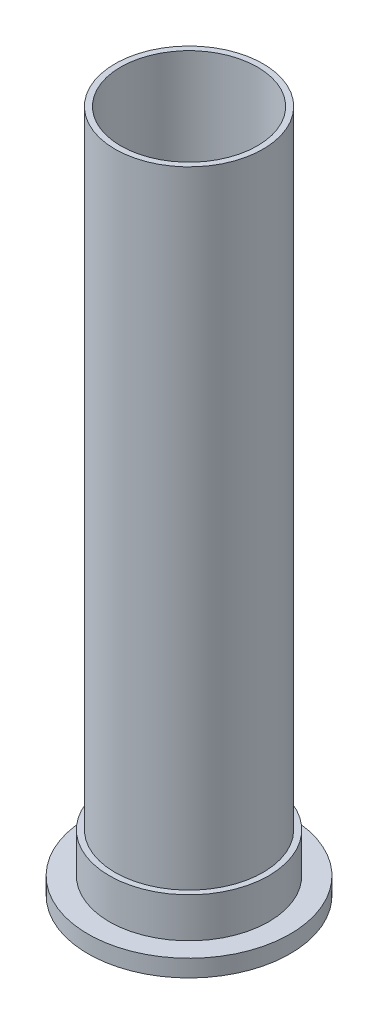
ISO-10303-21;
HEADER;
FILE_DESCRIPTION(('STEP AP214'),'2;1');
FILE_NAME('part.step','',(''),(''),'','','');
FILE_SCHEMA(('AUTOMOTIVE_DESIGN { 1 0 10303 214 1 1 1 1 }'));
ENDSEC;
DATA;
#1=APPLICATION_CONTEXT('core data for automotive mechanical design processes');
#2=APPLICATION_PROTOCOL_DEFINITION('international standard','automotive_design',2000,#1);
#3=PRODUCT_CONTEXT('',#1,'mechanical');
#4=PRODUCT('Part','Part','',(#3));
#5=PRODUCT_RELATED_PRODUCT_CATEGORY('part','',(#4));
#6=PRODUCT_DEFINITION_FORMATION('','',#4);
#7=PRODUCT_DEFINITION_CONTEXT('part definition',#1,'design');
#8=PRODUCT_DEFINITION('design','',#6,#7);
#9=PRODUCT_DEFINITION_SHAPE('','',#8);
#10=(LENGTH_UNIT() NAMED_UNIT(*) SI_UNIT(.MILLI.,.METRE.));
#11=(NAMED_UNIT(*) PLANE_ANGLE_UNIT() SI_UNIT($,.RADIAN.));
#12=(NAMED_UNIT(*) SI_UNIT($,.STERADIAN.) SOLID_ANGLE_UNIT());
#13=UNCERTAINTY_MEASURE_WITH_UNIT(LENGTH_MEASURE(1.E-05),#10,'distance_accuracy_value','');
#14=(GEOMETRIC_REPRESENTATION_CONTEXT(3) GLOBAL_UNCERTAINTY_ASSIGNED_CONTEXT((#13)) GLOBAL_UNIT_ASSIGNED_CONTEXT((#10,
#11,#12)) REPRESENTATION_CONTEXT('',''));
#15=CARTESIAN_POINT('',(0.,0.,0.));
#16=DIRECTION('',(0.,0.,1.));
#17=DIRECTION('',(1.,0.,0.));
#18=AXIS2_PLACEMENT_3D('',#15,#16,#17);
#19=CARTESIAN_POINT('',(0.,9.525,0.));
#20=DIRECTION('',(0.,-1.,0.));
#21=DIRECTION('',(0.,0.,-1.));
#22=AXIS2_PLACEMENT_3D('',#19,#20,#21);
#23=PLANE('',#22);
#24=CARTESIAN_POINT('',(0.,9.525,0.));
#25=DIRECTION('',(0.,-1.,0.));
#26=DIRECTION('',(0.,0.,-1.));
#27=AXIS2_PLACEMENT_3D('',#24,#25,#26);
#28=CIRCLE('',#27,56.35625);
#29=CARTESIAN_POINT('',(0.,9.525,-56.35625));
#30=VERTEX_POINT('',#29);
#31=EDGE_CURVE('E51',#30,#30,#28,.T.);
#32=ORIENTED_EDGE('',*,*,#31,.F.);
#33=EDGE_LOOP('',(#32));
#34=FACE_BOUND('',#33,.T.);
#35=CARTESIAN_POINT('',(0.,9.525,0.));
#36=DIRECTION('',(0.,-1.,0.));
#37=DIRECTION('',(0.,0.,-1.));
#38=AXIS2_PLACEMENT_3D('',#35,#36,#37);
#39=CIRCLE('',#38,44.45);
#40=CARTESIAN_POINT('',(0.,9.525,-44.45));
#41=VERTEX_POINT('',#40);
#42=EDGE_CURVE('E10',#41,#41,#39,.F.);
#43=ORIENTED_EDGE('',*,*,#42,.F.);
#44=EDGE_LOOP('',(#43));
#45=FACE_BOUND('',#44,.T.);
#46=ADVANCED_FACE('F35',(#34,#45),#23,.F.);
#47=CARTESIAN_POINT('',(0.,381.,0.));
#48=DIRECTION('',(0.,-1.,0.));
#49=DIRECTION('',(0.,0.,-1.));
#50=AXIS2_PLACEMENT_3D('',#47,#48,#49);
#51=CYLINDRICAL_SURFACE('',#50,38.1);
#52=CARTESIAN_POINT('',(0.,381.,0.));
#53=DIRECTION('',(0.,1.,0.));
#54=DIRECTION('',(0.,0.,1.));
#55=AXIS2_PLACEMENT_3D('',#52,#53,#54);
#56=CIRCLE('',#55,38.1);
#57=CARTESIAN_POINT('',(0.,381.,38.1));
#58=VERTEX_POINT('',#57);
#59=EDGE_CURVE('E46',#58,#58,#56,.T.);
#60=ORIENTED_EDGE('',*,*,#59,.T.);
#61=EDGE_LOOP('',(#60));
#62=FACE_BOUND('',#61,.T.);
#63=CARTESIAN_POINT('',(0.,28.575,0.));
#64=DIRECTION('',(0.,-1.,0.));
#65=DIRECTION('',(0.,0.,-1.));
#66=AXIS2_PLACEMENT_3D('',#63,#64,#65);
#67=CIRCLE('',#66,38.1);
#68=CARTESIAN_POINT('',(0.,28.575,-38.1));
#69=VERTEX_POINT('',#68);
#70=EDGE_CURVE('E54',#69,#69,#67,.T.);
#71=ORIENTED_EDGE('',*,*,#70,.T.);
#72=EDGE_LOOP('',(#71));
#73=FACE_BOUND('',#72,.T.);
#74=ADVANCED_FACE('F80',(#62,#73),#51,.F.);
#75=CARTESIAN_POINT('',(0.,381.,0.));
#76=DIRECTION('',(0.,-1.,0.));
#77=DIRECTION('',(0.,0.,-1.));
#78=AXIS2_PLACEMENT_3D('',#75,#76,#77);
#79=CYLINDRICAL_SURFACE('',#78,41.275);
#80=CARTESIAN_POINT('',(0.,31.75,0.));
#81=DIRECTION('',(0.,1.,0.));
#82=DIRECTION('',(0.,0.,1.));
#83=AXIS2_PLACEMENT_3D('',#80,#81,#82);
#84=CIRCLE('',#83,41.275);
#85=CARTESIAN_POINT('',(0.,31.75,41.275));
#86=VERTEX_POINT('',#85);
#87=EDGE_CURVE('E125',#86,#86,#84,.T.);
#88=ORIENTED_EDGE('',*,*,#87,.T.);
#89=EDGE_LOOP('',(#88));
#90=FACE_BOUND('',#89,.T.);
#91=CARTESIAN_POINT('',(0.,381.,0.));
#92=DIRECTION('',(0.,1.,0.));
#93=DIRECTION('',(0.,0.,1.));
#94=AXIS2_PLACEMENT_3D('',#91,#92,#93);
#95=CIRCLE('',#94,41.275);
#96=CARTESIAN_POINT('',(0.,381.,41.275));
#97=VERTEX_POINT('',#96);
#98=EDGE_CURVE('E42',#97,#97,#95,.T.);
#99=ORIENTED_EDGE('',*,*,#98,.F.);
#100=EDGE_LOOP('',(#99));
#101=FACE_BOUND('',#100,.T.);
#102=ADVANCED_FACE('F37',(#90,#101),#79,.T.);
#103=CARTESIAN_POINT('',(0.,381.,0.));
#104=DIRECTION('',(0.,1.,0.));
#105=DIRECTION('',(0.,0.,1.));
#106=AXIS2_PLACEMENT_3D('',#103,#104,#105);
#107=PLANE('',#106);
#108=ORIENTED_EDGE('',*,*,#98,.T.);
#109=EDGE_LOOP('',(#108));
#110=FACE_BOUND('',#109,.T.);
#111=ORIENTED_EDGE('',*,*,#59,.F.);
#112=EDGE_LOOP('',(#111));
#113=FACE_BOUND('',#112,.T.);
#114=ADVANCED_FACE('F94',(#110,#113),#107,.T.);
#115=CARTESIAN_POINT('',(0.,0.,0.));
#116=DIRECTION('',(0.,1.,0.));
#117=DIRECTION('',(0.,0.,1.));
#118=AXIS2_PLACEMENT_3D('',#115,#116,#117);
#119=PLANE('',#118);
#120=CARTESIAN_POINT('',(0.,0.,0.));
#121=DIRECTION('',(0.,-1.,0.));
#122=DIRECTION('',(0.,0.,-1.));
#123=AXIS2_PLACEMENT_3D('',#120,#121,#122);
#124=CIRCLE('',#123,39.75);
#125=CARTESIAN_POINT('',(0.,0.,-39.75));
#126=VERTEX_POINT('',#125);
#127=EDGE_CURVE('E62',#126,#126,#124,.T.);
#128=ORIENTED_EDGE('',*,*,#127,.F.);
#129=EDGE_LOOP('',(#128));
#130=FACE_BOUND('',#129,.T.);
#131=CARTESIAN_POINT('',(0.,0.,0.));
#132=DIRECTION('',(0.,-1.,0.));
#133=DIRECTION('',(0.,0.,-1.));
#134=AXIS2_PLACEMENT_3D('',#131,#132,#133);
#135=CIRCLE('',#134,56.35625);
#136=CARTESIAN_POINT('',(0.,0.,-56.35625));
#137=VERTEX_POINT('',#136);
#138=EDGE_CURVE('E56',#137,#137,#135,.T.);
#139=ORIENTED_EDGE('',*,*,#138,.T.);
#140=EDGE_LOOP('',(#139));
#141=FACE_BOUND('',#140,.T.);
#142=ADVANCED_FACE('F92',(#130,#141),#119,.F.);
#143=CARTESIAN_POINT('',(0.,9.525,0.));
#144=DIRECTION('',(0.,-1.,0.));
#145=DIRECTION('',(0.,0.,-1.));
#146=AXIS2_PLACEMENT_3D('',#143,#144,#145);
#147=CYLINDRICAL_SURFACE('',#146,56.35625);
#148=ORIENTED_EDGE('',*,*,#31,.T.);
#149=EDGE_LOOP('',(#148));
#150=FACE_BOUND('',#149,.T.);
#151=ORIENTED_EDGE('',*,*,#138,.F.);
#152=EDGE_LOOP('',(#151));
#153=FACE_BOUND('',#152,.T.);
#154=ADVANCED_FACE('F75',(#150,#153),#147,.T.);
#155=CARTESIAN_POINT('',(0.,28.575,0.));
#156=DIRECTION('',(0.,-1.,0.));
#157=DIRECTION('',(0.,0.,-1.));
#158=AXIS2_PLACEMENT_3D('',#155,#156,#157);
#159=CYLINDRICAL_SURFACE('',#158,39.75);
#160=CARTESIAN_POINT('',(0.,28.575,0.));
#161=DIRECTION('',(0.,-1.,0.));
#162=DIRECTION('',(0.,0.,-1.));
#163=AXIS2_PLACEMENT_3D('',#160,#161,#162);
#164=CIRCLE('',#163,39.75);
#165=CARTESIAN_POINT('',(0.,28.575,-39.75));
#166=VERTEX_POINT('',#165);
#167=EDGE_CURVE('E57',#166,#166,#164,.T.);
#168=ORIENTED_EDGE('',*,*,#167,.F.);
#169=EDGE_LOOP('',(#168));
#170=FACE_BOUND('',#169,.T.);
#171=ORIENTED_EDGE('',*,*,#127,.T.);
#172=EDGE_LOOP('',(#171));
#173=FACE_BOUND('',#172,.T.);
#174=ADVANCED_FACE('F89',(#170,#173),#159,.F.);
#175=CARTESIAN_POINT('',(0.,28.575,0.));
#176=DIRECTION('',(0.,-1.,0.));
#177=DIRECTION('',(0.,0.,-1.));
#178=AXIS2_PLACEMENT_3D('',#175,#176,#177);
#179=PLANE('',#178);
#180=ORIENTED_EDGE('',*,*,#70,.F.);
#181=EDGE_LOOP('',(#180));
#182=FACE_BOUND('',#181,.T.);
#183=ORIENTED_EDGE('',*,*,#167,.T.);
#184=EDGE_LOOP('',(#183));
#185=FACE_BOUND('',#184,.T.);
#186=ADVANCED_FACE('F105',(#182,#185),#179,.T.);
#187=CARTESIAN_POINT('',(0.,31.75,0.));
#188=DIRECTION('',(0.,1.,0.));
#189=DIRECTION('',(0.,0.,1.));
#190=AXIS2_PLACEMENT_3D('',#187,#188,#189);
#191=PLANE('',#190);
#192=CARTESIAN_POINT('',(0.,31.75,0.));
#193=DIRECTION('',(0.,1.,0.));
#194=DIRECTION('',(0.,0.,1.));
#195=AXIS2_PLACEMENT_3D('',#192,#193,#194);
#196=CIRCLE('',#195,44.45);
#197=CARTESIAN_POINT('',(0.,31.75,44.45));
#198=VERTEX_POINT('',#197);
#199=EDGE_CURVE('E67',#198,#198,#196,.T.);
#200=ORIENTED_EDGE('',*,*,#199,.T.);
#201=EDGE_LOOP('',(#200));
#202=FACE_BOUND('',#201,.T.);
#203=ORIENTED_EDGE('',*,*,#87,.F.);
#204=EDGE_LOOP('',(#203));
#205=FACE_BOUND('',#204,.T.);
#206=ADVANCED_FACE('F110',(#202,#205),#191,.T.);
#207=CARTESIAN_POINT('',(0.,31.75,0.));
#208=DIRECTION('',(0.,-1.,0.));
#209=DIRECTION('',(0.,0.,-1.));
#210=AXIS2_PLACEMENT_3D('',#207,#208,#209);
#211=CYLINDRICAL_SURFACE('',#210,44.45);
#212=ORIENTED_EDGE('',*,*,#199,.F.);
#213=EDGE_LOOP('',(#212));
#214=FACE_BOUND('',#213,.T.);
#215=ORIENTED_EDGE('',*,*,#42,.T.);
#216=EDGE_LOOP('',(#215));
#217=FACE_BOUND('',#216,.T.);
#218=ADVANCED_FACE('F115',(#214,#217),#211,.T.);
#219=CLOSED_SHELL('',(#46,#74,#102,#114,#142,#154,#174,#186,#206,#218));
#220=MANIFOLD_SOLID_BREP('B2',#219);
#221=ADVANCED_BREP_SHAPE_REPRESENTATION('',(#18,#220),#14);
#222=SHAPE_DEFINITION_REPRESENTATION(#9,#221);
ENDSEC;
END-ISO-10303-21;
